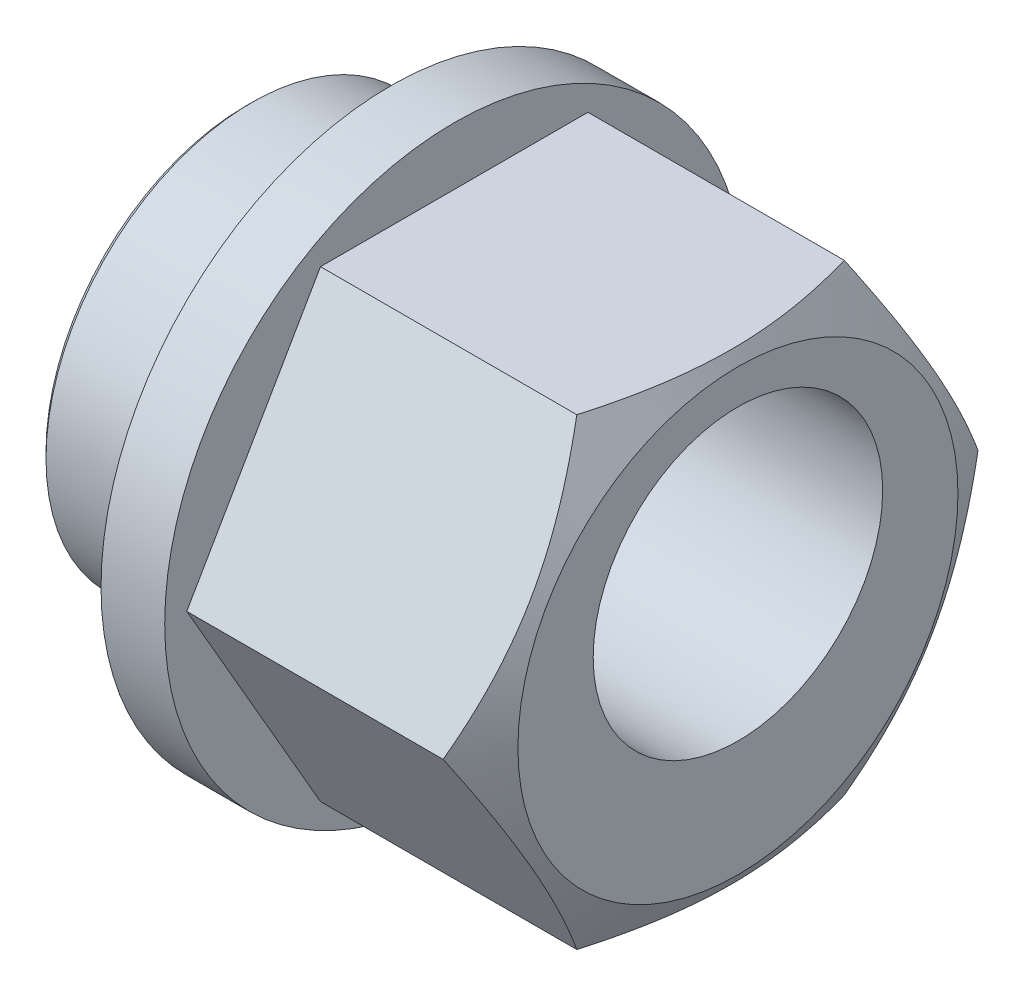
ISO-10303-21;
HEADER;
FILE_DESCRIPTION(('STEP AP214'),'2;1');
FILE_NAME('part.step','',(''),(''),'','','');
FILE_SCHEMA(('AUTOMOTIVE_DESIGN { 1 0 10303 214 1 1 1 1 }'));
ENDSEC;
DATA;
#1=APPLICATION_CONTEXT('core data for automotive mechanical design processes');
#2=APPLICATION_PROTOCOL_DEFINITION('international standard','automotive_design',2000,#1);
#3=PRODUCT_CONTEXT('',#1,'mechanical');
#4=PRODUCT('Part','Part','',(#3));
#5=PRODUCT_RELATED_PRODUCT_CATEGORY('part','',(#4));
#6=PRODUCT_DEFINITION_FORMATION('','',#4);
#7=PRODUCT_DEFINITION_CONTEXT('part definition',#1,'design');
#8=PRODUCT_DEFINITION('design','',#6,#7);
#9=PRODUCT_DEFINITION_SHAPE('','',#8);
#10=(LENGTH_UNIT() NAMED_UNIT(*) SI_UNIT(.MILLI.,.METRE.));
#11=(NAMED_UNIT(*) PLANE_ANGLE_UNIT() SI_UNIT($,.RADIAN.));
#12=(NAMED_UNIT(*) SI_UNIT($,.STERADIAN.) SOLID_ANGLE_UNIT());
#13=UNCERTAINTY_MEASURE_WITH_UNIT(LENGTH_MEASURE(1.E-05),#10,'distance_accuracy_value','');
#14=(GEOMETRIC_REPRESENTATION_CONTEXT(3) GLOBAL_UNCERTAINTY_ASSIGNED_CONTEXT((#13)) GLOBAL_UNIT_ASSIGNED_CONTEXT((#10,
#11,#12)) REPRESENTATION_CONTEXT('',''));
#15=CARTESIAN_POINT('',(0.,0.,0.));
#16=DIRECTION('',(0.,0.,1.));
#17=DIRECTION('',(1.,0.,0.));
#18=AXIS2_PLACEMENT_3D('',#15,#16,#17);
#19=CARTESIAN_POINT('',(4.25,0.,0.));
#20=DIRECTION('',(-1.,0.,0.));
#21=DIRECTION('',(0.,0.,1.));
#22=AXIS2_PLACEMENT_3D('',#19,#20,#21);
#23=PLANE('',#22);
#24=CARTESIAN_POINT('',(4.25,0.7,0.));
#25=DIRECTION('',(1.,0.,0.));
#26=DIRECTION('',(0.,0.,-1.));
#27=AXIS2_PLACEMENT_3D('',#24,#25,#26);
#28=CIRCLE('',#27,2.5);
#29=CARTESIAN_POINT('',(4.25,0.7,-2.5));
#30=VERTEX_POINT('',#29);
#31=EDGE_CURVE('E253',#30,#30,#28,.T.);
#32=ORIENTED_EDGE('',*,*,#31,.F.);
#33=EDGE_LOOP('',(#32));
#34=FACE_BOUND('',#33,.T.);
#35=CARTESIAN_POINT('',(4.25,0.,0.));
#36=DIRECTION('',(1.,0.,0.));
#37=DIRECTION('',(0.,0.,-1.));
#38=AXIS2_PLACEMENT_3D('',#35,#36,#37);
#39=CIRCLE('',#38,3.8);
#40=CARTESIAN_POINT('',(4.25,0.,-3.8));
#41=VERTEX_POINT('',#40);
#42=EDGE_CURVE('E238',#41,#41,#39,.T.);
#43=ORIENTED_EDGE('',*,*,#42,.T.);
#44=EDGE_LOOP('',(#43));
#45=FACE_BOUND('',#44,.T.);
#46=ADVANCED_FACE('F18',(#34,#45),#23,.F.);
#47=CARTESIAN_POINT('',(0.,0.,0.));
#48=DIRECTION('',(-1.,0.,0.));
#49=DIRECTION('',(0.,0.,1.));
#50=AXIS2_PLACEMENT_3D('',#47,#48,#49);
#51=CYLINDRICAL_SURFACE('',#50,5.);
#52=CARTESIAN_POINT('',(-1.75,0.,0.));
#53=DIRECTION('',(-1.,0.,0.));
#54=DIRECTION('',(0.,0.,1.));
#55=AXIS2_PLACEMENT_3D('',#52,#53,#54);
#56=CIRCLE('',#55,5.);
#57=CARTESIAN_POINT('',(-1.75,0.,5.));
#58=VERTEX_POINT('',#57);
#59=EDGE_CURVE('E109',#58,#58,#56,.T.);
#60=ORIENTED_EDGE('',*,*,#59,.F.);
#61=EDGE_LOOP('',(#60));
#62=FACE_BOUND('',#61,.T.);
#63=CARTESIAN_POINT('',(-0.65,0.,0.));
#64=DIRECTION('',(1.,0.,0.));
#65=DIRECTION('',(0.,0.,-1.));
#66=AXIS2_PLACEMENT_3D('',#63,#64,#65);
#67=CIRCLE('',#66,5.);
#68=CARTESIAN_POINT('',(-0.65,0.,-5.));
#69=VERTEX_POINT('',#68);
#70=EDGE_CURVE('E110',#69,#69,#67,.T.);
#71=ORIENTED_EDGE('',*,*,#70,.F.);
#72=EDGE_LOOP('',(#71));
#73=FACE_BOUND('',#72,.T.);
#74=ADVANCED_FACE('F131',(#62,#73),#51,.T.);
#75=CARTESIAN_POINT('',(0.,0.,0.));
#76=DIRECTION('',(-1.,0.,0.));
#77=DIRECTION('',(0.,0.,1.));
#78=AXIS2_PLACEMENT_3D('',#75,#76,#77);
#79=CYLINDRICAL_SURFACE('',#78,3.55);
#80=CARTESIAN_POINT('',(-4.15,0.,0.));
#81=DIRECTION('',(1.,0.,0.));
#82=DIRECTION('',(0.,0.,-1.));
#83=AXIS2_PLACEMENT_3D('',#80,#81,#82);
#84=CIRCLE('',#83,3.55);
#85=CARTESIAN_POINT('',(-4.15,0.,-3.55));
#86=VERTEX_POINT('',#85);
#87=EDGE_CURVE('E12',#86,#86,#84,.T.);
#88=ORIENTED_EDGE('',*,*,#87,.T.);
#89=EDGE_LOOP('',(#88));
#90=FACE_BOUND('',#89,.T.);
#91=CARTESIAN_POINT('',(-1.75,0.,0.));
#92=DIRECTION('',(-1.,0.,0.));
#93=DIRECTION('',(0.,0.,1.));
#94=AXIS2_PLACEMENT_3D('',#91,#92,#93);
#95=CIRCLE('',#94,3.55);
#96=CARTESIAN_POINT('',(-1.75,0.,3.55));
#97=VERTEX_POINT('',#96);
#98=EDGE_CURVE('E106',#97,#97,#95,.T.);
#99=ORIENTED_EDGE('',*,*,#98,.T.);
#100=EDGE_LOOP('',(#99));
#101=FACE_BOUND('',#100,.T.);
#102=ADVANCED_FACE('F137',(#90,#101),#79,.T.);
#103=CARTESIAN_POINT('',(-4.25,3.55,0.));
#104=DIRECTION('',(1.,0.,0.));
#105=DIRECTION('',(0.,0.,-1.));
#106=AXIS2_PLACEMENT_3D('',#103,#104,#105);
#107=PLANE('',#106);
#108=CARTESIAN_POINT('',(-4.25,0.,0.));
#109=DIRECTION('',(1.,0.,0.));
#110=DIRECTION('',(0.,0.,-1.));
#111=AXIS2_PLACEMENT_3D('',#108,#109,#110);
#112=CIRCLE('',#111,3.45);
#113=CARTESIAN_POINT('',(-4.25,0.,-3.45));
#114=VERTEX_POINT('',#113);
#115=EDGE_CURVE('E27',#114,#114,#112,.F.);
#116=ORIENTED_EDGE('',*,*,#115,.T.);
#117=EDGE_LOOP('',(#116));
#118=FACE_BOUND('',#117,.T.);
#119=CARTESIAN_POINT('',(-4.25,0.7,0.));
#120=DIRECTION('',(1.,0.,0.));
#121=DIRECTION('',(0.,0.,-1.));
#122=AXIS2_PLACEMENT_3D('',#119,#120,#121);
#123=CIRCLE('',#122,2.5);
#124=CARTESIAN_POINT('',(-4.25,0.7,-2.5));
#125=VERTEX_POINT('',#124);
#126=EDGE_CURVE('E104',#125,#125,#123,.T.);
#127=ORIENTED_EDGE('',*,*,#126,.T.);
#128=EDGE_LOOP('',(#127));
#129=FACE_BOUND('',#128,.T.);
#130=ADVANCED_FACE('F117',(#118,#129),#107,.F.);
#131=CARTESIAN_POINT('',(-1.75,5.,0.));
#132=DIRECTION('',(1.,0.,0.));
#133=DIRECTION('',(0.,0.,-1.));
#134=AXIS2_PLACEMENT_3D('',#131,#132,#133);
#135=PLANE('',#134);
#136=ORIENTED_EDGE('',*,*,#98,.F.);
#137=EDGE_LOOP('',(#136));
#138=FACE_BOUND('',#137,.T.);
#139=ORIENTED_EDGE('',*,*,#59,.T.);
#140=EDGE_LOOP('',(#139));
#141=FACE_BOUND('',#140,.T.);
#142=ADVANCED_FACE('F145',(#138,#141),#135,.F.);
#143=CARTESIAN_POINT('',(-0.65,5.,0.));
#144=DIRECTION('',(1.,0.,0.));
#145=DIRECTION('',(0.,0.,-1.));
#146=AXIS2_PLACEMENT_3D('',#143,#144,#145);
#147=PLANE('',#146);
#148=DIRECTION('',(0.,0.,-1.));
#149=VECTOR('',#148,1.);
#150=CARTESIAN_POINT('',(-0.65,4.,-2.3094010767585));
#151=LINE('',#150,#149);
#152=CARTESIAN_POINT('',(-0.65,4.,2.3094010767585));
#153=VERTEX_POINT('',#152);
#154=CARTESIAN_POINT('',(-0.65,4.,-2.3094010767585));
#155=VERTEX_POINT('',#154);
#156=EDGE_CURVE('E43',#153,#155,#151,.T.);
#157=ORIENTED_EDGE('',*,*,#156,.T.);
#158=DIRECTION('',(0.,-0.866025403784439,-0.5));
#159=VECTOR('',#158,1.);
#160=CARTESIAN_POINT('',(-0.65,0.,-4.61880215351701));
#161=LINE('',#160,#159);
#162=CARTESIAN_POINT('',(-0.65,0.,-4.61880215351701));
#163=VERTEX_POINT('',#162);
#164=EDGE_CURVE('E89',#155,#163,#161,.T.);
#165=ORIENTED_EDGE('',*,*,#164,.T.);
#166=DIRECTION('',(0.,-0.866025403784439,0.5));
#167=VECTOR('',#166,1.);
#168=CARTESIAN_POINT('',(-0.65,-4.,-2.3094010767585));
#169=LINE('',#168,#167);
#170=CARTESIAN_POINT('',(-0.65,-4.,-2.3094010767585));
#171=VERTEX_POINT('',#170);
#172=EDGE_CURVE('E87',#163,#171,#169,.T.);
#173=ORIENTED_EDGE('',*,*,#172,.T.);
#174=DIRECTION('',(0.,0.,1.));
#175=VECTOR('',#174,1.);
#176=CARTESIAN_POINT('',(-0.65,-4.,2.3094010767585));
#177=LINE('',#176,#175);
#178=CARTESIAN_POINT('',(-0.65,-4.,2.3094010767585));
#179=VERTEX_POINT('',#178);
#180=EDGE_CURVE('E73',#171,#179,#177,.T.);
#181=ORIENTED_EDGE('',*,*,#180,.T.);
#182=DIRECTION('',(0.,0.866025403784439,0.5));
#183=VECTOR('',#182,1.);
#184=CARTESIAN_POINT('',(-0.65,0.,4.61880215351701));
#185=LINE('',#184,#183);
#186=CARTESIAN_POINT('',(-0.65,0.,4.61880215351701));
#187=VERTEX_POINT('',#186);
#188=EDGE_CURVE('E62',#179,#187,#185,.T.);
#189=ORIENTED_EDGE('',*,*,#188,.T.);
#190=DIRECTION('',(0.,0.866025403784439,-0.5));
#191=VECTOR('',#190,1.);
#192=CARTESIAN_POINT('',(-0.65,4.,2.3094010767585));
#193=LINE('',#192,#191);
#194=EDGE_CURVE('E72',#187,#153,#193,.T.);
#195=ORIENTED_EDGE('',*,*,#194,.T.);
#196=EDGE_LOOP('',(#157,#165,#173,#181,#189,#195));
#197=FACE_BOUND('',#196,.T.);
#198=ORIENTED_EDGE('',*,*,#70,.T.);
#199=EDGE_LOOP('',(#198));
#200=FACE_BOUND('',#199,.T.);
#201=ADVANCED_FACE('F84',(#197,#200),#147,.T.);
#202=CARTESIAN_POINT('',(-16.0335569799683,4.,-2.3094010767585));
#203=DIRECTION('',(0.,1.,0.));
#204=DIRECTION('',(0.,0.,1.));
#205=AXIS2_PLACEMENT_3D('',#202,#203,#204);
#206=PLANE('',#205);
#207=CARTESIAN_POINT('',(1.73903500372011,4.,-7.09986898854242));
#208=CARTESIAN_POINT('',(1.82401447484536,4.,-6.93090236300421));
#209=CARTESIAN_POINT('',(1.90843152837534,4.,-6.76164997769999));
#210=CARTESIAN_POINT('',(2.07586490697229,4.,-6.42244808584381));
#211=CARTESIAN_POINT('',(2.15888119096687,4.,-6.25249855903174));
#212=CARTESIAN_POINT('',(2.3233915261239,4.,-5.91145621928106));
#213=CARTESIAN_POINT('',(2.4048823122561,4.,-5.74036182813148));
#214=CARTESIAN_POINT('',(2.56579851935266,4.,-5.39719962569316));
#215=CARTESIAN_POINT('',(2.64522390919013,4.,-5.22513179978165));
#216=CARTESIAN_POINT('',(2.8051582275215,4.,-4.87181565074145));
#217=CARTESIAN_POINT('',(2.88554597976929,4.,-4.69051229691261));
#218=CARTESIAN_POINT('',(3.04280264619397,4.,-4.32638745436553));
#219=CARTESIAN_POINT('',(3.11967167750481,4.,-4.14356601642217));
#220=CARTESIAN_POINT('',(3.26887735121311,4.,-3.77623253385384));
#221=CARTESIAN_POINT('',(3.34121737793309,4.,-3.59172187260495));
#222=CARTESIAN_POINT('',(3.48017313905204,4.,-3.22048998783952));
#223=CARTESIAN_POINT('',(3.54678731784276,4.,-3.03376817917293));
#224=CARTESIAN_POINT('',(3.68654190906176,4.,-2.61622194266073));
#225=CARTESIAN_POINT('',(3.75786647109341,4.,-2.38477830768362));
#226=CARTESIAN_POINT('',(3.88554749479653,4.,-1.91786123684729));
#227=CARTESIAN_POINT('',(3.94191256867129,4.,-1.68239020305142));
#228=CARTESIAN_POINT('',(4.03423842299116,4.,-1.21152411326326));
#229=CARTESIAN_POINT('',(4.07053375752981,4.,-0.976197531890145));
#230=CARTESIAN_POINT('',(4.10779159205885,4.,-0.621479556012492));
#231=CARTESIAN_POINT('',(4.11734660453728,4.,-0.50296101606619));
#232=CARTESIAN_POINT('',(4.13044867127537,4.,-0.265582340529043));
#233=CARTESIAN_POINT('',(4.13399572439976,4.,-0.146722204873655));
#234=CARTESIAN_POINT('',(4.1349557029556,4.,0.0918884648862517));
#235=CARTESIAN_POINT('',(4.13232371474901,4.,0.21163917228027));
#236=CARTESIAN_POINT('',(4.12092630123704,4.,0.450845545918229));
#237=CARTESIAN_POINT('',(4.11216086226366,4.,0.570301211504093));
#238=CARTESIAN_POINT('',(4.08878430267177,4.,0.808672884349576));
#239=CARTESIAN_POINT('',(4.07417131619039,4.,0.927588707093193));
#240=CARTESIAN_POINT('',(4.03954459874811,4.,1.16463829797905));
#241=CARTESIAN_POINT('',(4.01953006255915,4.,1.28277194682761));
#242=CARTESIAN_POINT('',(3.95140245714248,4.,1.63985902986957));
#243=CARTESIAN_POINT('',(3.89564183473407,4.,1.87736560321856));
#244=CARTESIAN_POINT('',(3.76869436337913,4.,2.34823104585473));
#245=CARTESIAN_POINT('',(3.69749821667786,4.,2.58158732309298));
#246=CARTESIAN_POINT('',(3.55766514314151,4.,3.0025942788233));
#247=CARTESIAN_POINT('',(3.49089618820632,4.,3.19087480014237));
#248=CARTESIAN_POINT('',(3.35146863961068,4.,3.56516766830677));
#249=CARTESIAN_POINT('',(3.27881171329061,4.,3.75118064022486));
#250=CARTESIAN_POINT('',(3.12885419774335,4.,4.1214825575821));
#251=CARTESIAN_POINT('',(3.0515500352191,4.,4.30577004713549));
#252=CARTESIAN_POINT('',(2.89333940258833,4.,4.67279364133969));
#253=CARTESIAN_POINT('',(2.81243280764526,4.,4.85552969196618));
#254=CARTESIAN_POINT('',(2.65145963644676,4.,5.21154538454408));
#255=CARTESIAN_POINT('',(2.57151800411206,4.,5.3848817056069));
#256=CARTESIAN_POINT('',(2.40953028805451,4.,5.73056300914421));
#257=CARTESIAN_POINT('',(2.3274842375911,4.,5.90290800723351));
#258=CARTESIAN_POINT('',(2.16184121646979,4.,6.24642327504975));
#259=CARTESIAN_POINT('',(2.07824768763602,4.,6.41759520789347));
#260=CARTESIAN_POINT('',(1.90963779265439,4.,6.75923098852321));
#261=CARTESIAN_POINT('',(1.82462146906748,4.,6.92969485730029));
#262=CARTESIAN_POINT('',(1.73903500372011,4.,7.09986898854242));
#263=B_SPLINE_CURVE_WITH_KNOTS('',3,(#207,#208,#209,#210,#211,#212,#213,#214,#215,#216,#217,
#218,#219,#220,#221,#222,#223,#224,#225,#226,#227,#228,#229,#230,#231,#232,#233,#234,#235,#236,
#237,#238,#239,#240,#241,#242,#243,#244,#245,#246,#247,#248,#249,#250,#251,#252,#253,#254,#255,
#256,#257,#258,#259,#260,#261,#262),.UNSPECIFIED.,.F.,.F.,(4,2,2,2,2,2,2,2,2,2,2,2,2,2,2,2,2,2,
2,2,2,2,2,2,2,2,2,4),(0.,0.56740132746923,1.13481926307612,1.70333782287546,2.27186494566636,
2.86681263083415,3.46174049649138,4.05621835824453,4.65085722162199,5.37703172582904,
6.10278725879283,6.81604897618862,7.17262725420784,7.52920559960629,7.88838382437828,
8.24756284955802,8.60685657476856,8.96620389077497,9.69732347663913,10.4288846899732,
11.0280732355998,11.627092693548,12.2265787843283,12.8260856655337,13.3987165003011,
13.9713382904498,14.5428112423109,15.1142671297896),.UNSPECIFIED.);
#264=CARTESIAN_POINT('',(3.77726435625392,4.,-2.3094010767585));
#265=VERTEX_POINT('',#264);
#266=CARTESIAN_POINT('',(3.77726435625392,4.,2.3094010767585));
#267=VERTEX_POINT('',#266);
#268=EDGE_CURVE('E215',#265,#267,#263,.T.);
#269=ORIENTED_EDGE('',*,*,#268,.F.);
#270=DIRECTION('',(1.,0.,0.));
#271=VECTOR('',#270,1.);
#272=CARTESIAN_POINT('',(-16.0335569799683,4.,-2.3094010767585));
#273=LINE('',#272,#271);
#274=EDGE_CURVE('E101',#155,#265,#273,.T.);
#275=ORIENTED_EDGE('',*,*,#274,.F.);
#276=ORIENTED_EDGE('',*,*,#156,.F.);
#277=DIRECTION('',(1.,0.,0.));
#278=VECTOR('',#277,1.);
#279=CARTESIAN_POINT('',(-16.0335569799683,4.,2.3094010767585));
#280=LINE('',#279,#278);
#281=EDGE_CURVE('E99',#153,#267,#280,.T.);
#282=ORIENTED_EDGE('',*,*,#281,.T.);
#283=EDGE_LOOP('',(#269,#275,#276,#282));
#284=FACE_BOUND('',#283,.T.);
#285=ADVANCED_FACE('F159',(#284),#206,.T.);
#286=CARTESIAN_POINT('',(-16.0335569799683,4.,2.3094010767585));
#287=DIRECTION('',(0.,0.5,0.866025403784439));
#288=DIRECTION('',(0.,-0.866025403784439,0.5));
#289=AXIS2_PLACEMENT_3D('',#286,#287,#288);
#290=PLANE('',#289);
#291=CARTESIAN_POINT('',(3.77719768708731,4.0002,2.30928560670467));
#292=CARTESIAN_POINT('',(3.8358120725138,3.82442084967677,2.41077174646171));
#293=CARTESIAN_POINT('',(3.88911962469982,3.64712438367362,2.513133908835));
#294=CARTESIAN_POINT('',(3.98216827541567,3.28946140682429,2.71963072479812));
#295=CARTESIAN_POINT('',(4.02187645713237,3.10908854102985,2.82376904741904));
#296=CARTESIAN_POINT('',(4.0836877308818,2.75057818129721,3.03075510011795));
#297=CARTESIAN_POINT('',(4.10620221463919,2.57249584706486,3.13357098372492));
#298=CARTESIAN_POINT('',(4.1330793230155,2.21549328283349,3.33968651028528));
#299=CARTESIAN_POINT('',(4.13746420473513,2.0365743503559,3.44298540411434));
#300=CARTESIAN_POINT('',(4.12833987322211,1.70225715780327,3.63600352522932));
#301=CARTESIAN_POINT('',(4.11707099217408,1.54680884001294,3.72575165335065));
#302=CARTESIAN_POINT('',(4.08135595536389,1.23692494436495,3.90466320392054));
#303=CARTESIAN_POINT('',(4.05689760045055,1.08249043825587,3.99382600759478));
#304=CARTESIAN_POINT('',(3.99575388124279,0.771967672225423,4.17310641015197));
#305=CARTESIAN_POINT('',(3.95880934250722,0.615918711936899,4.26320131938131));
#306=CARTESIAN_POINT('',(3.87495987361405,0.306148164596162,4.4420474282755));
#307=CARTESIAN_POINT('',(3.82807464394934,0.152422609226222,4.53080091904966));
#308=CARTESIAN_POINT('',(3.77719768708731,-0.000199999999998588,4.61891762357084));
#309=B_SPLINE_CURVE_WITH_KNOTS('',3,(#291,#292,#293,#294,#295,#296,#297,#298,#299,#300,#301,
#302,#303,#304,#305,#306,#307,#308),.UNSPECIFIED.,.F.,.F.,(4,2,2,2,2,2,2,2,4),(0.,
0.634047835695965,1.26961969224543,1.88946157213122,2.50854226669297,3.04757825393385,
3.58711366126903,4.13861653143763,4.68903648037743),.UNSPECIFIED.);
#310=CARTESIAN_POINT('',(3.77726435625392,0.,4.61880215351701));
#311=VERTEX_POINT('',#310);
#312=EDGE_CURVE('E208',#267,#311,#309,.T.);
#313=ORIENTED_EDGE('',*,*,#312,.F.);
#314=ORIENTED_EDGE('',*,*,#281,.F.);
#315=ORIENTED_EDGE('',*,*,#194,.F.);
#316=DIRECTION('',(1.,0.,0.));
#317=VECTOR('',#316,1.);
#318=CARTESIAN_POINT('',(-16.0335569799683,0.,4.61880215351701));
#319=LINE('',#318,#317);
#320=EDGE_CURVE('E69',#187,#311,#319,.T.);
#321=ORIENTED_EDGE('',*,*,#320,.T.);
#322=EDGE_LOOP('',(#313,#314,#315,#321));
#323=FACE_BOUND('',#322,.T.);
#324=ADVANCED_FACE('F164',(#323),#290,.T.);
#325=CARTESIAN_POINT('',(-16.0335569799683,0.,4.61880215351701));
#326=DIRECTION('',(0.,-0.5,0.866025403784439));
#327=DIRECTION('',(0.,-0.866025403784439,-0.5));
#328=AXIS2_PLACEMENT_3D('',#325,#326,#327);
#329=PLANE('',#328);
#330=CARTESIAN_POINT('',(3.77719768708731,0.00020000000000089,4.61891762357084));
#331=CARTESIAN_POINT('',(3.8358120725138,-0.175579150323227,4.51743148381381));
#332=CARTESIAN_POINT('',(3.88911962469982,-0.35287561632638,4.41506932144052));
#333=CARTESIAN_POINT('',(3.98216827541568,-0.710538593175705,4.20857250547739));
#334=CARTESIAN_POINT('',(4.02187645713238,-0.890911458970149,4.10443418285647));
#335=CARTESIAN_POINT('',(4.0836877308818,-1.24942181870279,3.89744813015756));
#336=CARTESIAN_POINT('',(4.10620221463919,-1.42750415293514,3.79463224655059));
#337=CARTESIAN_POINT('',(4.1330793230155,-1.78450671716651,3.58851671999023));
#338=CARTESIAN_POINT('',(4.13746420473513,-1.9634256496441,3.48521782616117));
#339=CARTESIAN_POINT('',(4.12833987322211,-2.29774284219673,3.29219970504619));
#340=CARTESIAN_POINT('',(4.11707099217408,-2.45319115998706,3.20245157692486));
#341=CARTESIAN_POINT('',(4.08135595536389,-2.76307505563505,3.02354002635497));
#342=CARTESIAN_POINT('',(4.05689760045055,-2.91750956174413,2.93437722268073));
#343=CARTESIAN_POINT('',(3.99575388124279,-3.22803232777458,2.75509682012354));
#344=CARTESIAN_POINT('',(3.95880934250722,-3.3840812880631,2.6650019108942));
#345=CARTESIAN_POINT('',(3.87495987361405,-3.69385183540384,2.48615580200001));
#346=CARTESIAN_POINT('',(3.82807464394934,-3.84757739077378,2.39740231122585));
#347=CARTESIAN_POINT('',(3.77719768708731,-4.0002,2.30928560670466));
#348=B_SPLINE_CURVE_WITH_KNOTS('',3,(#330,#331,#332,#333,#334,#335,#336,#337,#338,#339,#340,
#341,#342,#343,#344,#345,#346,#347),.UNSPECIFIED.,.F.,.F.,(4,2,2,2,2,2,2,2,4),(0.,
0.634047835695966,1.26961969224543,1.88946157213122,2.50854226669297,3.04757825393385,
3.58711366126903,4.13861653143764,4.68903648037743),.UNSPECIFIED.);
#349=CARTESIAN_POINT('',(3.77726435625424,-4.,2.30940107675905));
#350=VERTEX_POINT('',#349);
#351=EDGE_CURVE('E202',#311,#350,#348,.T.);
#352=ORIENTED_EDGE('',*,*,#351,.F.);
#353=ORIENTED_EDGE('',*,*,#320,.F.);
#354=ORIENTED_EDGE('',*,*,#188,.F.);
#355=DIRECTION('',(1.,0.,0.));
#356=VECTOR('',#355,1.);
#357=CARTESIAN_POINT('',(-16.0335569799683,-4.,2.3094010767585));
#358=LINE('',#357,#356);
#359=EDGE_CURVE('E67',#179,#350,#358,.T.);
#360=ORIENTED_EDGE('',*,*,#359,.T.);
#361=EDGE_LOOP('',(#352,#353,#354,#360));
#362=FACE_BOUND('',#361,.T.);
#363=ADVANCED_FACE('F65',(#362),#329,.T.);
#364=CARTESIAN_POINT('',(-16.0335569799683,-4.,2.3094010767585));
#365=DIRECTION('',(0.,-1.,0.));
#366=DIRECTION('',(0.,0.,-1.));
#367=AXIS2_PLACEMENT_3D('',#364,#365,#366);
#368=PLANE('',#367);
#369=CARTESIAN_POINT('',(1.73903500372011,-4.,7.09986898854242));
#370=CARTESIAN_POINT('',(1.82401447484536,-4.,6.93090236300421));
#371=CARTESIAN_POINT('',(1.90843152837534,-4.,6.76164997769999));
#372=CARTESIAN_POINT('',(2.07586490697229,-4.,6.42244808584381));
#373=CARTESIAN_POINT('',(2.15888119096687,-4.,6.25249855903174));
#374=CARTESIAN_POINT('',(2.3233915261239,-4.,5.91145621928106));
#375=CARTESIAN_POINT('',(2.4048823122561,-4.,5.74036182813148));
#376=CARTESIAN_POINT('',(2.56579851935266,-4.,5.39719962569316));
#377=CARTESIAN_POINT('',(2.64522390919013,-4.,5.22513179978165));
#378=CARTESIAN_POINT('',(2.8051582275215,-4.,4.87181565074146));
#379=CARTESIAN_POINT('',(2.88554597976929,-4.,4.69051229691261));
#380=CARTESIAN_POINT('',(3.04280264619397,-4.,4.32638745436553));
#381=CARTESIAN_POINT('',(3.11967167750481,-4.,4.14356601642217));
#382=CARTESIAN_POINT('',(3.26887735121311,-4.,3.77623253385384));
#383=CARTESIAN_POINT('',(3.34121737793309,-4.,3.59172187260495));
#384=CARTESIAN_POINT('',(3.48017313905204,-4.,3.22048998783952));
#385=CARTESIAN_POINT('',(3.54678731784276,-4.,3.03376817917293));
#386=CARTESIAN_POINT('',(3.68654190906176,-4.,2.61622194266073));
#387=CARTESIAN_POINT('',(3.75786647109341,-4.,2.38477830768362));
#388=CARTESIAN_POINT('',(3.88554749479653,-4.,1.91786123684729));
#389=CARTESIAN_POINT('',(3.94191256867129,-4.,1.68239020305142));
#390=CARTESIAN_POINT('',(4.03423842299116,-4.,1.21152411326326));
#391=CARTESIAN_POINT('',(4.07053375752981,-4.,0.976197531890145));
#392=CARTESIAN_POINT('',(4.10779159205885,-4.,0.621479556012492));
#393=CARTESIAN_POINT('',(4.11734660453728,-4.,0.50296101606619));
#394=CARTESIAN_POINT('',(4.13044867127537,-4.,0.265582340529043));
#395=CARTESIAN_POINT('',(4.13399572439976,-4.,0.146722204873655));
#396=CARTESIAN_POINT('',(4.1349557029556,-4.,-0.0918884648862517));
#397=CARTESIAN_POINT('',(4.13232371474901,-4.,-0.21163917228027));
#398=CARTESIAN_POINT('',(4.12092630123704,-4.,-0.450845545918229));
#399=CARTESIAN_POINT('',(4.11216086226366,-4.,-0.570301211504093));
#400=CARTESIAN_POINT('',(4.08878430267177,-4.,-0.808672884349576));
#401=CARTESIAN_POINT('',(4.07417131619039,-4.,-0.927588707093193));
#402=CARTESIAN_POINT('',(4.03954459874811,-4.,-1.16463829797905));
#403=CARTESIAN_POINT('',(4.01953006255915,-4.,-1.28277194682761));
#404=CARTESIAN_POINT('',(3.95140245714248,-4.,-1.63985902986957));
#405=CARTESIAN_POINT('',(3.89564183473407,-4.,-1.87736560321856));
#406=CARTESIAN_POINT('',(3.76869436337913,-4.,-2.34823104585473));
#407=CARTESIAN_POINT('',(3.69749821667786,-4.,-2.58158732309298));
#408=CARTESIAN_POINT('',(3.55766514314151,-4.,-3.0025942788233));
#409=CARTESIAN_POINT('',(3.49089618820632,-4.,-3.19087480014237));
#410=CARTESIAN_POINT('',(3.35146863961068,-4.,-3.56516766830677));
#411=CARTESIAN_POINT('',(3.27881171329061,-4.,-3.75118064022486));
#412=CARTESIAN_POINT('',(3.12885419774335,-4.,-4.1214825575821));
#413=CARTESIAN_POINT('',(3.0515500352191,-4.,-4.30577004713549));
#414=CARTESIAN_POINT('',(2.89333940258833,-4.,-4.67279364133969));
#415=CARTESIAN_POINT('',(2.81243280764526,-4.,-4.85552969196618));
#416=CARTESIAN_POINT('',(2.65145963644676,-4.,-5.21154538454408));
#417=CARTESIAN_POINT('',(2.57151800411206,-4.,-5.3848817056069));
#418=CARTESIAN_POINT('',(2.40953028805451,-4.,-5.73056300914421));
#419=CARTESIAN_POINT('',(2.3274842375911,-4.,-5.90290800723351));
#420=CARTESIAN_POINT('',(2.16184121646979,-4.,-6.24642327504975));
#421=CARTESIAN_POINT('',(2.07824768763602,-4.,-6.41759520789347));
#422=CARTESIAN_POINT('',(1.90963779265439,-4.,-6.75923098852321));
#423=CARTESIAN_POINT('',(1.82462146906748,-4.,-6.92969485730029));
#424=CARTESIAN_POINT('',(1.73903500372011,-4.,-7.09986898854242));
#425=B_SPLINE_CURVE_WITH_KNOTS('',3,(#369,#370,#371,#372,#373,#374,#375,#376,#377,#378,#379,
#380,#381,#382,#383,#384,#385,#386,#387,#388,#389,#390,#391,#392,#393,#394,#395,#396,#397,#398,
#399,#400,#401,#402,#403,#404,#405,#406,#407,#408,#409,#410,#411,#412,#413,#414,#415,#416,#417,
#418,#419,#420,#421,#422,#423,#424),.UNSPECIFIED.,.F.,.F.,(4,2,2,2,2,2,2,2,2,2,2,2,2,2,2,2,2,2,
2,2,2,2,2,2,2,2,2,4),(0.,0.56740132746923,1.13481926307612,1.70333782287546,2.27186494566636,
2.86681263083414,3.46174049649138,4.05621835824453,4.65085722162199,5.37703172582904,
6.10278725879283,6.81604897618862,7.17262725420784,7.52920559960629,7.88838382437828,
8.24756284955802,8.60685657476856,8.96620389077497,9.69732347663913,10.4288846899732,
11.0280732355998,11.627092693548,12.2265787843283,12.8260856655337,13.3987165003011,
13.9713382904498,14.5428112423109,15.1142671297896),.UNSPECIFIED.);
#426=CARTESIAN_POINT('',(3.77726435625392,-4.,-2.3094010767585));
#427=VERTEX_POINT('',#426);
#428=EDGE_CURVE('E80',#350,#427,#425,.T.);
#429=ORIENTED_EDGE('',*,*,#428,.F.);
#430=ORIENTED_EDGE('',*,*,#359,.F.);
#431=ORIENTED_EDGE('',*,*,#180,.F.);
#432=DIRECTION('',(1.,0.,0.));
#433=VECTOR('',#432,1.);
#434=CARTESIAN_POINT('',(-16.0335569799683,-4.,-2.3094010767585));
#435=LINE('',#434,#433);
#436=EDGE_CURVE('E81',#171,#427,#435,.T.);
#437=ORIENTED_EDGE('',*,*,#436,.T.);
#438=EDGE_LOOP('',(#429,#430,#431,#437));
#439=FACE_BOUND('',#438,.T.);
#440=ADVANCED_FACE('F77',(#439),#368,.T.);
#441=CARTESIAN_POINT('',(-16.0335569799683,-4.,-2.3094010767585));
#442=DIRECTION('',(0.,-0.5,-0.866025403784439));
#443=DIRECTION('',(0.,0.866025403784439,-0.5));
#444=AXIS2_PLACEMENT_3D('',#441,#442,#443);
#445=PLANE('',#444);
#446=CARTESIAN_POINT('',(3.77719768708731,-4.0002,-2.30928560670467));
#447=CARTESIAN_POINT('',(3.8358120725138,-3.82442084967677,-2.4107717464617));
#448=CARTESIAN_POINT('',(3.88911962469982,-3.64712438367362,-2.51313390883499));
#449=CARTESIAN_POINT('',(3.98216827541567,-3.28946140682429,-2.71963072479812));
#450=CARTESIAN_POINT('',(4.02187645713237,-3.10908854102985,-2.82376904741904));
#451=CARTESIAN_POINT('',(4.0836877308818,-2.75057818129721,-3.03075510011795));
#452=CARTESIAN_POINT('',(4.10620221463919,-2.57249584706486,-3.13357098372492));
#453=CARTESIAN_POINT('',(4.1330793230155,-2.21549328283349,-3.33968651028528));
#454=CARTESIAN_POINT('',(4.13746420473513,-2.0365743503559,-3.44298540411434));
#455=CARTESIAN_POINT('',(4.12833987322211,-1.70225715780327,-3.63600352522932));
#456=CARTESIAN_POINT('',(4.11707099217408,-1.54680884001294,-3.72575165335065));
#457=CARTESIAN_POINT('',(4.08135595536389,-1.23692494436495,-3.90466320392054));
#458=CARTESIAN_POINT('',(4.05689760045055,-1.08249043825587,-3.99382600759478));
#459=CARTESIAN_POINT('',(3.99575388124279,-0.771967672225424,-4.17310641015197));
#460=CARTESIAN_POINT('',(3.95880934250722,-0.6159187119369,-4.26320131938131));
#461=CARTESIAN_POINT('',(3.87495987361405,-0.306148164596162,-4.4420474282755));
#462=CARTESIAN_POINT('',(3.82807464394934,-0.152422609226222,-4.53080091904966));
#463=CARTESIAN_POINT('',(3.77719768708731,0.000199999999999009,-4.61891762357084));
#464=B_SPLINE_CURVE_WITH_KNOTS('',3,(#446,#447,#448,#449,#450,#451,#452,#453,#454,#455,#456,
#457,#458,#459,#460,#461,#462,#463),.UNSPECIFIED.,.F.,.F.,(4,2,2,2,2,2,2,2,4),(0.,
0.634047835695966,1.26961969224543,1.88946157213122,2.50854226669297,3.04757825393385,
3.58711366126903,4.13861653143763,4.68903648037743),.UNSPECIFIED.);
#465=CARTESIAN_POINT('',(3.77726435625392,0.,-4.61880215351701));
#466=VERTEX_POINT('',#465);
#467=EDGE_CURVE('E34',#427,#466,#464,.T.);
#468=ORIENTED_EDGE('',*,*,#467,.F.);
#469=ORIENTED_EDGE('',*,*,#436,.F.);
#470=ORIENTED_EDGE('',*,*,#172,.F.);
#471=DIRECTION('',(1.,0.,0.));
#472=VECTOR('',#471,1.);
#473=CARTESIAN_POINT('',(-16.0335569799683,0.,-4.61880215351701));
#474=LINE('',#473,#472);
#475=EDGE_CURVE('E94',#163,#466,#474,.T.);
#476=ORIENTED_EDGE('',*,*,#475,.T.);
#477=EDGE_LOOP('',(#468,#469,#470,#476));
#478=FACE_BOUND('',#477,.T.);
#479=ADVANCED_FACE('F168',(#478),#445,.T.);
#480=CARTESIAN_POINT('',(-16.0335569799683,0.,-4.61880215351701));
#481=DIRECTION('',(0.,0.5,-0.866025403784438));
#482=DIRECTION('',(0.,0.866025403784439,0.5));
#483=AXIS2_PLACEMENT_3D('',#480,#481,#482);
#484=PLANE('',#483);
#485=CARTESIAN_POINT('',(3.77719768708731,-0.000200000000000849,-4.61891762357084));
#486=CARTESIAN_POINT('',(3.8358120725138,0.175579150323227,-4.5174314838138));
#487=CARTESIAN_POINT('',(3.88911962469982,0.35287561632638,-4.41506932144052));
#488=CARTESIAN_POINT('',(3.98216827541568,0.710538593175705,-4.2085725054774));
#489=CARTESIAN_POINT('',(4.02187645713238,0.890911458970149,-4.10443418285647));
#490=CARTESIAN_POINT('',(4.0836877308818,1.24942181870279,-3.89744813015756));
#491=CARTESIAN_POINT('',(4.10620221463919,1.42750415293514,-3.79463224655059));
#492=CARTESIAN_POINT('',(4.1330793230155,1.78450671716651,-3.58851671999023));
#493=CARTESIAN_POINT('',(4.13746420473514,1.9634256496441,-3.48521782616117));
#494=CARTESIAN_POINT('',(4.12833987322211,2.29774284219673,-3.29219970504619));
#495=CARTESIAN_POINT('',(4.11707099217408,2.45319115998706,-3.20245157692486));
#496=CARTESIAN_POINT('',(4.08135595536389,2.76307505563505,-3.02354002635497));
#497=CARTESIAN_POINT('',(4.05689760045055,2.91750956174413,-2.93437722268073));
#498=CARTESIAN_POINT('',(3.99575388124279,3.22803232777458,-2.75509682012354));
#499=CARTESIAN_POINT('',(3.95880934250722,3.3840812880631,-2.6650019108942));
#500=CARTESIAN_POINT('',(3.87495987361405,3.69385183540384,-2.48615580200001));
#501=CARTESIAN_POINT('',(3.82807464394934,3.84757739077378,-2.39740231122585));
#502=CARTESIAN_POINT('',(3.77719768708731,4.0002,-2.30928560670466));
#503=B_SPLINE_CURVE_WITH_KNOTS('',3,(#485,#486,#487,#488,#489,#490,#491,#492,#493,#494,#495,
#496,#497,#498,#499,#500,#501,#502),.UNSPECIFIED.,.F.,.F.,(4,2,2,2,2,2,2,2,4),(0.,
0.634047835695966,1.26961969224543,1.88946157213122,2.50854226669297,3.04757825393385,
3.58711366126903,4.13861653143764,4.68903648037743),.UNSPECIFIED.);
#504=EDGE_CURVE('E183',#466,#265,#503,.T.);
#505=ORIENTED_EDGE('',*,*,#504,.F.);
#506=ORIENTED_EDGE('',*,*,#475,.F.);
#507=ORIENTED_EDGE('',*,*,#164,.F.);
#508=ORIENTED_EDGE('',*,*,#274,.T.);
#509=EDGE_LOOP('',(#505,#506,#507,#508));
#510=FACE_BOUND('',#509,.T.);
#511=ADVANCED_FACE('F172',(#510),#484,.T.);
#512=CARTESIAN_POINT('',(-4.25,0.7,0.));
#513=DIRECTION('',(1.,0.,0.));
#514=DIRECTION('',(0.,0.,-1.));
#515=AXIS2_PLACEMENT_3D('',#512,#513,#514);
#516=CYLINDRICAL_SURFACE('',#515,2.5);
#517=ORIENTED_EDGE('',*,*,#126,.F.);
#518=EDGE_LOOP('',(#517));
#519=FACE_BOUND('',#518,.T.);
#520=ORIENTED_EDGE('',*,*,#31,.T.);
#521=EDGE_LOOP('',(#520));
#522=FACE_BOUND('',#521,.T.);
#523=ADVANCED_FACE('F127',(#519,#522),#516,.F.);
#524=CARTESIAN_POINT('',(2.97982940778284,0.,0.));
#525=DIRECTION('',(-1.,0.,0.));
#526=DIRECTION('',(0.,0.,1.));
#527=AXIS2_PLACEMENT_3D('',#524,#525,#526);
#528=CONICAL_SURFACE('',#527,6.,1.0471975511966);
#529=ORIENTED_EDGE('',*,*,#268,.T.);
#530=ORIENTED_EDGE('',*,*,#312,.T.);
#531=ORIENTED_EDGE('',*,*,#351,.T.);
#532=ORIENTED_EDGE('',*,*,#428,.T.);
#533=ORIENTED_EDGE('',*,*,#467,.T.);
#534=ORIENTED_EDGE('',*,*,#504,.T.);
#535=EDGE_LOOP('',(#529,#530,#531,#532,#533,#534));
#536=FACE_BOUND('',#535,.T.);
#537=ORIENTED_EDGE('',*,*,#42,.F.);
#538=EDGE_LOOP('',(#537));
#539=FACE_BOUND('',#538,.T.);
#540=ADVANCED_FACE('F121',(#536,#539),#528,.T.);
#541=CARTESIAN_POINT('',(-4.25,0.,0.));
#542=DIRECTION('',(1.,0.,0.));
#543=DIRECTION('',(0.,0.,-1.));
#544=AXIS2_PLACEMENT_3D('',#541,#542,#543);
#545=CONICAL_SURFACE('',#544,3.45,0.785398163397435);
#546=ORIENTED_EDGE('',*,*,#87,.F.);
#547=EDGE_LOOP('',(#546));
#548=FACE_BOUND('',#547,.T.);
#549=ORIENTED_EDGE('',*,*,#115,.F.);
#550=EDGE_LOOP('',(#549));
#551=FACE_BOUND('',#550,.T.);
#552=ADVANCED_FACE('F21',(#548,#551),#545,.T.);
#553=CLOSED_SHELL('',(#46,#74,#102,#130,#142,#201,#285,#324,#363,#440,#479,#511,#523,#540,#552));
#554=MANIFOLD_SOLID_BREP('B1',#553);
#555=ADVANCED_BREP_SHAPE_REPRESENTATION('',(#18,#554),#14);
#556=SHAPE_DEFINITION_REPRESENTATION(#9,#555);
ENDSEC;
END-ISO-10303-21;
